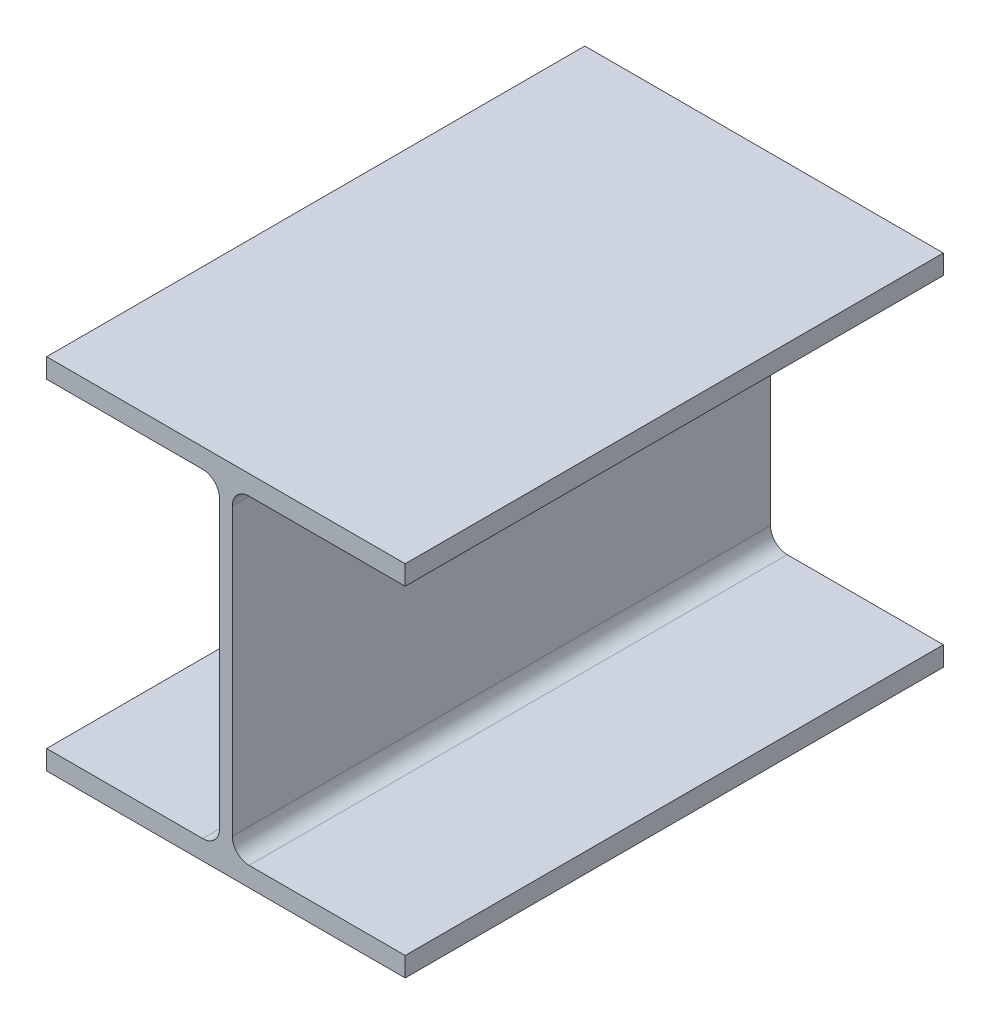
ISO-10303-21;
HEADER;
FILE_DESCRIPTION(('STEP AP214'),'2;1');
FILE_NAME('part.step','',(''),(''),'','','');
FILE_SCHEMA(('AUTOMOTIVE_DESIGN { 1 0 10303 214 1 1 1 1 }'));
ENDSEC;
DATA;
#1=APPLICATION_CONTEXT('core data for automotive mechanical design processes');
#2=APPLICATION_PROTOCOL_DEFINITION('international standard','automotive_design',2000,#1);
#3=PRODUCT_CONTEXT('',#1,'mechanical');
#4=PRODUCT('Part','Part','',(#3));
#5=PRODUCT_RELATED_PRODUCT_CATEGORY('part','',(#4));
#6=PRODUCT_DEFINITION_FORMATION('','',#4);
#7=PRODUCT_DEFINITION_CONTEXT('part definition',#1,'design');
#8=PRODUCT_DEFINITION('design','',#6,#7);
#9=PRODUCT_DEFINITION_SHAPE('','',#8);
#10=(LENGTH_UNIT() NAMED_UNIT(*) SI_UNIT(.MILLI.,.METRE.));
#11=(NAMED_UNIT(*) PLANE_ANGLE_UNIT() SI_UNIT($,.RADIAN.));
#12=(NAMED_UNIT(*) SI_UNIT($,.STERADIAN.) SOLID_ANGLE_UNIT());
#13=UNCERTAINTY_MEASURE_WITH_UNIT(LENGTH_MEASURE(1.E-05),#10,'distance_accuracy_value','');
#14=(GEOMETRIC_REPRESENTATION_CONTEXT(3) GLOBAL_UNCERTAINTY_ASSIGNED_CONTEXT((#13)) GLOBAL_UNIT_ASSIGNED_CONTEXT((#10,
#11,#12)) REPRESENTATION_CONTEXT('',''));
#15=CARTESIAN_POINT('',(0.,0.,0.));
#16=DIRECTION('',(0.,0.,1.));
#17=DIRECTION('',(1.,0.,0.));
#18=AXIS2_PLACEMENT_3D('',#15,#16,#17);
#19=CARTESIAN_POINT('',(-101.5365,-90.551,152.4));
#20=DIRECTION('',(1.,0.,0.));
#21=DIRECTION('',(0.,0.,-1.));
#22=AXIS2_PLACEMENT_3D('',#19,#20,#21);
#23=PLANE('',#22);
#24=DIRECTION('',(0.,-1.,0.));
#25=VECTOR('',#24,1.);
#26=CARTESIAN_POINT('',(-101.5365,-90.551,-152.4));
#27=LINE('',#26,#25);
#28=CARTESIAN_POINT('',(-101.5365,-90.551,-152.4));
#29=VERTEX_POINT('',#28);
#30=CARTESIAN_POINT('',(-101.5365,-101.6,-152.4));
#31=VERTEX_POINT('',#30);
#32=EDGE_CURVE('E169',#29,#31,#27,.T.);
#33=ORIENTED_EDGE('',*,*,#32,.T.);
#34=DIRECTION('',(0.,0.,-1.));
#35=VECTOR('',#34,1.);
#36=CARTESIAN_POINT('',(-101.5365,-101.6,152.4));
#37=LINE('',#36,#35);
#38=CARTESIAN_POINT('',(-101.5365,-101.6,152.4));
#39=VERTEX_POINT('',#38);
#40=EDGE_CURVE('E151',#39,#31,#37,.T.);
#41=ORIENTED_EDGE('',*,*,#40,.F.);
#42=DIRECTION('',(0.,-1.,0.));
#43=VECTOR('',#42,1.);
#44=CARTESIAN_POINT('',(-101.5365,-90.551,152.4));
#45=LINE('',#44,#43);
#46=CARTESIAN_POINT('',(-101.5365,-90.551,152.4));
#47=VERTEX_POINT('',#46);
#48=EDGE_CURVE('E158',#47,#39,#45,.T.);
#49=ORIENTED_EDGE('',*,*,#48,.F.);
#50=DIRECTION('',(0.,0.,-1.));
#51=VECTOR('',#50,1.);
#52=CARTESIAN_POINT('',(-101.5365,-90.551,152.4));
#53=LINE('',#52,#51);
#54=EDGE_CURVE('E216',#47,#29,#53,.T.);
#55=ORIENTED_EDGE('',*,*,#54,.T.);
#56=EDGE_LOOP('',(#33,#41,#49,#55));
#57=FACE_BOUND('',#56,.T.);
#58=ADVANCED_FACE('F35',(#57),#23,.F.);
#59=CARTESIAN_POINT('',(-101.5365,-101.6,152.4));
#60=DIRECTION('',(0.,1.,0.));
#61=DIRECTION('',(-1.,0.,0.));
#62=AXIS2_PLACEMENT_3D('',#59,#60,#61);
#63=PLANE('',#62);
#64=DIRECTION('',(1.,0.,0.));
#65=VECTOR('',#64,1.);
#66=CARTESIAN_POINT('',(-101.5365,-101.6,-152.4));
#67=LINE('',#66,#65);
#68=CARTESIAN_POINT('',(101.5365,-101.6,-152.4));
#69=VERTEX_POINT('',#68);
#70=EDGE_CURVE('E254',#31,#69,#67,.T.);
#71=ORIENTED_EDGE('',*,*,#70,.T.);
#72=DIRECTION('',(0.,0.,-1.));
#73=VECTOR('',#72,1.);
#74=CARTESIAN_POINT('',(101.5365,-101.6,152.4));
#75=LINE('',#74,#73);
#76=CARTESIAN_POINT('',(101.5365,-101.6,152.4));
#77=VERTEX_POINT('',#76);
#78=EDGE_CURVE('E153',#77,#69,#75,.T.);
#79=ORIENTED_EDGE('',*,*,#78,.F.);
#80=DIRECTION('',(1.,0.,0.));
#81=VECTOR('',#80,1.);
#82=CARTESIAN_POINT('',(-101.5365,-101.6,152.4));
#83=LINE('',#82,#81);
#84=EDGE_CURVE('E146',#39,#77,#83,.T.);
#85=ORIENTED_EDGE('',*,*,#84,.F.);
#86=ORIENTED_EDGE('',*,*,#40,.T.);
#87=EDGE_LOOP('',(#71,#79,#85,#86));
#88=FACE_BOUND('',#87,.T.);
#89=ADVANCED_FACE('F149',(#88),#63,.F.);
#90=CARTESIAN_POINT('',(101.5365,-90.551,152.4));
#91=DIRECTION('',(1.,0.,0.));
#92=DIRECTION('',(0.,1.,0.));
#93=AXIS2_PLACEMENT_3D('',#90,#91,#92);
#94=PLANE('',#93);
#95=DIRECTION('',(0.,-1.,0.));
#96=VECTOR('',#95,1.);
#97=CARTESIAN_POINT('',(101.5365,-90.551,-152.4));
#98=LINE('',#97,#96);
#99=CARTESIAN_POINT('',(101.5365,-90.551,-152.4));
#100=VERTEX_POINT('',#99);
#101=EDGE_CURVE('E252',#100,#69,#98,.T.);
#102=ORIENTED_EDGE('',*,*,#101,.F.);
#103=DIRECTION('',(0.,0.,-1.));
#104=VECTOR('',#103,1.);
#105=CARTESIAN_POINT('',(101.5365,-90.551,152.4));
#106=LINE('',#105,#104);
#107=CARTESIAN_POINT('',(101.5365,-90.551,152.4));
#108=VERTEX_POINT('',#107);
#109=EDGE_CURVE('E174',#108,#100,#106,.T.);
#110=ORIENTED_EDGE('',*,*,#109,.F.);
#111=DIRECTION('',(0.,-1.,0.));
#112=VECTOR('',#111,1.);
#113=CARTESIAN_POINT('',(101.5365,-90.551,152.4));
#114=LINE('',#113,#112);
#115=EDGE_CURVE('E157',#108,#77,#114,.T.);
#116=ORIENTED_EDGE('',*,*,#115,.T.);
#117=ORIENTED_EDGE('',*,*,#78,.T.);
#118=EDGE_LOOP('',(#102,#110,#116,#117));
#119=FACE_BOUND('',#118,.T.);
#120=ADVANCED_FACE('F253',(#119),#94,.T.);
#121=CARTESIAN_POINT('',(3.61950000000003,-90.551,152.4));
#122=DIRECTION('',(0.,1.,0.));
#123=DIRECTION('',(0.,0.,1.));
#124=AXIS2_PLACEMENT_3D('',#121,#122,#123);
#125=PLANE('',#124);
#126=DIRECTION('',(1.,0.,0.));
#127=VECTOR('',#126,1.);
#128=CARTESIAN_POINT('',(3.61950000000003,-90.551,-152.4));
#129=LINE('',#128,#127);
#130=CARTESIAN_POINT('',(13.1445,-90.551,-152.4));
#131=VERTEX_POINT('',#130);
#132=EDGE_CURVE('E248',#131,#100,#129,.T.);
#133=ORIENTED_EDGE('',*,*,#132,.F.);
#134=DIRECTION('',(0.,0.,-1.));
#135=VECTOR('',#134,1.);
#136=CARTESIAN_POINT('',(13.1445,-90.551,152.4));
#137=LINE('',#136,#135);
#138=CARTESIAN_POINT('',(13.1445,-90.551,152.4));
#139=VERTEX_POINT('',#138);
#140=EDGE_CURVE('E50',#131,#139,#137,.F.);
#141=ORIENTED_EDGE('',*,*,#140,.T.);
#142=DIRECTION('',(1.,0.,0.));
#143=VECTOR('',#142,1.);
#144=CARTESIAN_POINT('',(3.61950000000003,-90.551,152.4));
#145=LINE('',#144,#143);
#146=EDGE_CURVE('E249',#139,#108,#145,.T.);
#147=ORIENTED_EDGE('',*,*,#146,.T.);
#148=ORIENTED_EDGE('',*,*,#109,.T.);
#149=EDGE_LOOP('',(#133,#141,#147,#148));
#150=FACE_BOUND('',#149,.T.);
#151=ADVANCED_FACE('F247',(#150),#125,.T.);
#152=CARTESIAN_POINT('',(3.6195,90.551,152.4));
#153=DIRECTION('',(1.,0.,0.));
#154=DIRECTION('',(0.,1.,0.));
#155=AXIS2_PLACEMENT_3D('',#152,#153,#154);
#156=PLANE('',#155);
#157=DIRECTION('',(0.,-1.,0.));
#158=VECTOR('',#157,1.);
#159=CARTESIAN_POINT('',(3.6195,90.551,-152.4));
#160=LINE('',#159,#158);
#161=CARTESIAN_POINT('',(3.6195,81.026,-152.4));
#162=VERTEX_POINT('',#161);
#163=CARTESIAN_POINT('',(3.61950000000002,-81.026,-152.4));
#164=VERTEX_POINT('',#163);
#165=EDGE_CURVE('E256',#162,#164,#160,.T.);
#166=ORIENTED_EDGE('',*,*,#165,.F.);
#167=DIRECTION('',(0.,0.,-1.));
#168=VECTOR('',#167,1.);
#169=CARTESIAN_POINT('',(3.6195,81.026,152.4));
#170=LINE('',#169,#168);
#171=CARTESIAN_POINT('',(3.6195,81.026,152.4));
#172=VERTEX_POINT('',#171);
#173=EDGE_CURVE('E188',#162,#172,#170,.F.);
#174=ORIENTED_EDGE('',*,*,#173,.T.);
#175=DIRECTION('',(0.,-1.,0.));
#176=VECTOR('',#175,1.);
#177=CARTESIAN_POINT('',(3.6195,90.551,152.4));
#178=LINE('',#177,#176);
#179=CARTESIAN_POINT('',(3.61950000000002,-81.026,152.4));
#180=VERTEX_POINT('',#179);
#181=EDGE_CURVE('E299',#172,#180,#178,.T.);
#182=ORIENTED_EDGE('',*,*,#181,.T.);
#183=DIRECTION('',(0.,0.,-1.));
#184=VECTOR('',#183,1.);
#185=CARTESIAN_POINT('',(3.61950000000003,-81.026,-152.4));
#186=LINE('',#185,#184);
#187=EDGE_CURVE('E185',#180,#164,#186,.T.);
#188=ORIENTED_EDGE('',*,*,#187,.T.);
#189=EDGE_LOOP('',(#166,#174,#182,#188));
#190=FACE_BOUND('',#189,.T.);
#191=ADVANCED_FACE('F309',(#190),#156,.T.);
#192=CARTESIAN_POINT('',(3.6195,90.551,152.4));
#193=DIRECTION('',(0.,1.,0.));
#194=DIRECTION('',(0.,0.,1.));
#195=AXIS2_PLACEMENT_3D('',#192,#193,#194);
#196=PLANE('',#195);
#197=DIRECTION('',(1.,0.,0.));
#198=VECTOR('',#197,1.);
#199=CARTESIAN_POINT('',(3.6195,90.551,152.4));
#200=LINE('',#199,#198);
#201=CARTESIAN_POINT('',(13.1445,90.551,152.4));
#202=VERTEX_POINT('',#201);
#203=CARTESIAN_POINT('',(101.5365,90.551,152.4));
#204=VERTEX_POINT('',#203);
#205=EDGE_CURVE('E297',#202,#204,#200,.T.);
#206=ORIENTED_EDGE('',*,*,#205,.F.);
#207=DIRECTION('',(0.,0.,-1.));
#208=VECTOR('',#207,1.);
#209=CARTESIAN_POINT('',(13.1445,90.551,152.4));
#210=LINE('',#209,#208);
#211=CARTESIAN_POINT('',(13.1445,90.551,-152.4));
#212=VERTEX_POINT('',#211);
#213=EDGE_CURVE('E182',#202,#212,#210,.T.);
#214=ORIENTED_EDGE('',*,*,#213,.T.);
#215=DIRECTION('',(1.,0.,0.));
#216=VECTOR('',#215,1.);
#217=CARTESIAN_POINT('',(3.6195,90.551,-152.4));
#218=LINE('',#217,#216);
#219=CARTESIAN_POINT('',(101.5365,90.551,-152.4));
#220=VERTEX_POINT('',#219);
#221=EDGE_CURVE('E262',#212,#220,#218,.T.);
#222=ORIENTED_EDGE('',*,*,#221,.T.);
#223=DIRECTION('',(0.,0.,-1.));
#224=VECTOR('',#223,1.);
#225=CARTESIAN_POINT('',(101.5365,90.551,152.4));
#226=LINE('',#225,#224);
#227=EDGE_CURVE('E242',#204,#220,#226,.T.);
#228=ORIENTED_EDGE('',*,*,#227,.F.);
#229=EDGE_LOOP('',(#206,#214,#222,#228));
#230=FACE_BOUND('',#229,.T.);
#231=ADVANCED_FACE('F318',(#230),#196,.F.);
#232=CARTESIAN_POINT('',(101.5365,101.6,152.4));
#233=DIRECTION('',(1.,0.,0.));
#234=DIRECTION('',(0.,1.,0.));
#235=AXIS2_PLACEMENT_3D('',#232,#233,#234);
#236=PLANE('',#235);
#237=DIRECTION('',(0.,-1.,0.));
#238=VECTOR('',#237,1.);
#239=CARTESIAN_POINT('',(101.5365,101.6,-152.4));
#240=LINE('',#239,#238);
#241=CARTESIAN_POINT('',(101.5365,101.6,-152.4));
#242=VERTEX_POINT('',#241);
#243=EDGE_CURVE('E264',#242,#220,#240,.T.);
#244=ORIENTED_EDGE('',*,*,#243,.F.);
#245=DIRECTION('',(0.,0.,-1.));
#246=VECTOR('',#245,1.);
#247=CARTESIAN_POINT('',(101.5365,101.6,152.4));
#248=LINE('',#247,#246);
#249=CARTESIAN_POINT('',(101.5365,101.6,152.4));
#250=VERTEX_POINT('',#249);
#251=EDGE_CURVE('E240',#250,#242,#248,.T.);
#252=ORIENTED_EDGE('',*,*,#251,.F.);
#253=DIRECTION('',(0.,-1.,0.));
#254=VECTOR('',#253,1.);
#255=CARTESIAN_POINT('',(101.5365,101.6,152.4));
#256=LINE('',#255,#254);
#257=EDGE_CURVE('E294',#250,#204,#256,.T.);
#258=ORIENTED_EDGE('',*,*,#257,.T.);
#259=ORIENTED_EDGE('',*,*,#227,.T.);
#260=EDGE_LOOP('',(#244,#252,#258,#259));
#261=FACE_BOUND('',#260,.T.);
#262=ADVANCED_FACE('F325',(#261),#236,.T.);
#263=CARTESIAN_POINT('',(-101.5365,101.6,152.4));
#264=DIRECTION('',(0.,1.,0.));
#265=DIRECTION('',(-1.,0.,0.));
#266=AXIS2_PLACEMENT_3D('',#263,#264,#265);
#267=PLANE('',#266);
#268=DIRECTION('',(1.,0.,0.));
#269=VECTOR('',#268,1.);
#270=CARTESIAN_POINT('',(-101.5365,101.6,-152.4));
#271=LINE('',#270,#269);
#272=CARTESIAN_POINT('',(-101.5365,101.6,-152.4));
#273=VERTEX_POINT('',#272);
#274=EDGE_CURVE('E267',#273,#242,#271,.T.);
#275=ORIENTED_EDGE('',*,*,#274,.F.);
#276=DIRECTION('',(0.,0.,-1.));
#277=VECTOR('',#276,1.);
#278=CARTESIAN_POINT('',(-101.5365,101.6,152.4));
#279=LINE('',#278,#277);
#280=CARTESIAN_POINT('',(-101.5365,101.6,152.4));
#281=VERTEX_POINT('',#280);
#282=EDGE_CURVE('E238',#281,#273,#279,.T.);
#283=ORIENTED_EDGE('',*,*,#282,.F.);
#284=DIRECTION('',(1.,0.,0.));
#285=VECTOR('',#284,1.);
#286=CARTESIAN_POINT('',(-101.5365,101.6,152.4));
#287=LINE('',#286,#285);
#288=EDGE_CURVE('E289',#281,#250,#287,.T.);
#289=ORIENTED_EDGE('',*,*,#288,.T.);
#290=ORIENTED_EDGE('',*,*,#251,.T.);
#291=EDGE_LOOP('',(#275,#283,#289,#290));
#292=FACE_BOUND('',#291,.T.);
#293=ADVANCED_FACE('F323',(#292),#267,.T.);
#294=CARTESIAN_POINT('',(-101.5365,101.6,152.4));
#295=DIRECTION('',(1.,0.,0.));
#296=DIRECTION('',(0.,1.,0.));
#297=AXIS2_PLACEMENT_3D('',#294,#295,#296);
#298=PLANE('',#297);
#299=DIRECTION('',(0.,-1.,0.));
#300=VECTOR('',#299,1.);
#301=CARTESIAN_POINT('',(-101.5365,101.6,-152.4));
#302=LINE('',#301,#300);
#303=CARTESIAN_POINT('',(-101.5365,90.551,-152.4));
#304=VERTEX_POINT('',#303);
#305=EDGE_CURVE('E230',#273,#304,#302,.T.);
#306=ORIENTED_EDGE('',*,*,#305,.T.);
#307=DIRECTION('',(0.,0.,-1.));
#308=VECTOR('',#307,1.);
#309=CARTESIAN_POINT('',(-101.5365,90.551,152.4));
#310=LINE('',#309,#308);
#311=CARTESIAN_POINT('',(-101.5365,90.551,152.4));
#312=VERTEX_POINT('',#311);
#313=EDGE_CURVE('E235',#312,#304,#310,.T.);
#314=ORIENTED_EDGE('',*,*,#313,.F.);
#315=DIRECTION('',(0.,-1.,0.));
#316=VECTOR('',#315,1.);
#317=CARTESIAN_POINT('',(-101.5365,101.6,152.4));
#318=LINE('',#317,#316);
#319=EDGE_CURVE('E286',#281,#312,#318,.T.);
#320=ORIENTED_EDGE('',*,*,#319,.F.);
#321=ORIENTED_EDGE('',*,*,#282,.T.);
#322=EDGE_LOOP('',(#306,#314,#320,#321));
#323=FACE_BOUND('',#322,.T.);
#324=ADVANCED_FACE('F272',(#323),#298,.F.);
#325=CARTESIAN_POINT('',(-101.5365,90.551,152.4));
#326=DIRECTION('',(0.,1.,0.));
#327=DIRECTION('',(0.,0.,1.));
#328=AXIS2_PLACEMENT_3D('',#325,#326,#327);
#329=PLANE('',#328);
#330=DIRECTION('',(1.,0.,0.));
#331=VECTOR('',#330,1.);
#332=CARTESIAN_POINT('',(-101.5365,90.551,-152.4));
#333=LINE('',#332,#331);
#334=CARTESIAN_POINT('',(-13.1445,90.551,-152.4));
#335=VERTEX_POINT('',#334);
#336=EDGE_CURVE('E226',#304,#335,#333,.T.);
#337=ORIENTED_EDGE('',*,*,#336,.T.);
#338=DIRECTION('',(0.,0.,-1.));
#339=VECTOR('',#338,1.);
#340=CARTESIAN_POINT('',(-13.1445,90.551,152.4));
#341=LINE('',#340,#339);
#342=CARTESIAN_POINT('',(-13.1445,90.551,152.4));
#343=VERTEX_POINT('',#342);
#344=EDGE_CURVE('E180',#335,#343,#341,.F.);
#345=ORIENTED_EDGE('',*,*,#344,.T.);
#346=DIRECTION('',(1.,0.,0.));
#347=VECTOR('',#346,1.);
#348=CARTESIAN_POINT('',(-101.5365,90.551,152.4));
#349=LINE('',#348,#347);
#350=EDGE_CURVE('E281',#312,#343,#349,.T.);
#351=ORIENTED_EDGE('',*,*,#350,.F.);
#352=ORIENTED_EDGE('',*,*,#313,.T.);
#353=EDGE_LOOP('',(#337,#345,#351,#352));
#354=FACE_BOUND('',#353,.T.);
#355=ADVANCED_FACE('F278',(#354),#329,.F.);
#356=CARTESIAN_POINT('',(-3.6195,90.551,152.4));
#357=DIRECTION('',(1.,0.,0.));
#358=DIRECTION('',(0.,1.,0.));
#359=AXIS2_PLACEMENT_3D('',#356,#357,#358);
#360=PLANE('',#359);
#361=DIRECTION('',(0.,-1.,0.));
#362=VECTOR('',#361,1.);
#363=CARTESIAN_POINT('',(-3.6195,90.551,152.4));
#364=LINE('',#363,#362);
#365=CARTESIAN_POINT('',(-3.6195,81.026,152.4));
#366=VERTEX_POINT('',#365);
#367=CARTESIAN_POINT('',(-3.61950000000002,-81.026,152.4));
#368=VERTEX_POINT('',#367);
#369=EDGE_CURVE('E208',#366,#368,#364,.T.);
#370=ORIENTED_EDGE('',*,*,#369,.F.);
#371=DIRECTION('',(0.,0.,-1.));
#372=VECTOR('',#371,1.);
#373=CARTESIAN_POINT('',(-3.6195,81.026,-152.4));
#374=LINE('',#373,#372);
#375=CARTESIAN_POINT('',(-3.6195,81.026,-152.4));
#376=VERTEX_POINT('',#375);
#377=EDGE_CURVE('E172',#366,#376,#374,.T.);
#378=ORIENTED_EDGE('',*,*,#377,.T.);
#379=DIRECTION('',(0.,-1.,0.));
#380=VECTOR('',#379,1.);
#381=CARTESIAN_POINT('',(-3.6195,90.551,-152.4));
#382=LINE('',#381,#380);
#383=CARTESIAN_POINT('',(-3.61950000000002,-81.026,-152.4));
#384=VERTEX_POINT('',#383);
#385=EDGE_CURVE('E222',#376,#384,#382,.T.);
#386=ORIENTED_EDGE('',*,*,#385,.T.);
#387=DIRECTION('',(0.,0.,-1.));
#388=VECTOR('',#387,1.);
#389=CARTESIAN_POINT('',(-3.61950000000002,-81.026,152.4));
#390=LINE('',#389,#388);
#391=EDGE_CURVE('E170',#384,#368,#390,.F.);
#392=ORIENTED_EDGE('',*,*,#391,.T.);
#393=EDGE_LOOP('',(#370,#378,#386,#392));
#394=FACE_BOUND('',#393,.T.);
#395=ADVANCED_FACE('F224',(#394),#360,.F.);
#396=CARTESIAN_POINT('',(-101.5365,-90.551,152.4));
#397=DIRECTION('',(0.,1.,0.));
#398=DIRECTION('',(0.,0.,1.));
#399=AXIS2_PLACEMENT_3D('',#396,#397,#398);
#400=PLANE('',#399);
#401=DIRECTION('',(1.,0.,0.));
#402=VECTOR('',#401,1.);
#403=CARTESIAN_POINT('',(-101.5365,-90.551,152.4));
#404=LINE('',#403,#402);
#405=CARTESIAN_POINT('',(-13.1445,-90.551,152.4));
#406=VERTEX_POINT('',#405);
#407=EDGE_CURVE('E164',#47,#406,#404,.T.);
#408=ORIENTED_EDGE('',*,*,#407,.T.);
#409=DIRECTION('',(0.,0.,-1.));
#410=VECTOR('',#409,1.);
#411=CARTESIAN_POINT('',(-13.1445,-90.551,152.4));
#412=LINE('',#411,#410);
#413=CARTESIAN_POINT('',(-13.1445,-90.551,-152.4));
#414=VERTEX_POINT('',#413);
#415=EDGE_CURVE('E190',#406,#414,#412,.T.);
#416=ORIENTED_EDGE('',*,*,#415,.T.);
#417=DIRECTION('',(1.,0.,0.));
#418=VECTOR('',#417,1.);
#419=CARTESIAN_POINT('',(-101.5365,-90.551,-152.4));
#420=LINE('',#419,#418);
#421=EDGE_CURVE('E166',#29,#414,#420,.T.);
#422=ORIENTED_EDGE('',*,*,#421,.F.);
#423=ORIENTED_EDGE('',*,*,#54,.F.);
#424=EDGE_LOOP('',(#408,#416,#422,#423));
#425=FACE_BOUND('',#424,.T.);
#426=ADVANCED_FACE('F213',(#425),#400,.T.);
#427=CARTESIAN_POINT('',(0.,0.,152.4));
#428=DIRECTION('',(0.,0.,1.));
#429=DIRECTION('',(1.,0.,0.));
#430=AXIS2_PLACEMENT_3D('',#427,#428,#429);
#431=PLANE('',#430);
#432=ORIENTED_EDGE('',*,*,#48,.T.);
#433=ORIENTED_EDGE('',*,*,#84,.T.);
#434=ORIENTED_EDGE('',*,*,#115,.F.);
#435=ORIENTED_EDGE('',*,*,#146,.F.);
#436=CARTESIAN_POINT('',(13.1445,-81.026,152.4));
#437=DIRECTION('',(0.,0.,1.));
#438=DIRECTION('',(1.,0.,0.));
#439=AXIS2_PLACEMENT_3D('',#436,#437,#438);
#440=CIRCLE('',#439,9.525);
#441=EDGE_CURVE('E11',#139,#180,#440,.F.);
#442=ORIENTED_EDGE('',*,*,#441,.T.);
#443=ORIENTED_EDGE('',*,*,#181,.F.);
#444=CARTESIAN_POINT('',(13.1445,81.026,152.4));
#445=DIRECTION('',(0.,0.,1.));
#446=DIRECTION('',(1.,0.,0.));
#447=AXIS2_PLACEMENT_3D('',#444,#445,#446);
#448=CIRCLE('',#447,9.525);
#449=EDGE_CURVE('E200',#172,#202,#448,.F.);
#450=ORIENTED_EDGE('',*,*,#449,.T.);
#451=ORIENTED_EDGE('',*,*,#205,.T.);
#452=ORIENTED_EDGE('',*,*,#257,.F.);
#453=ORIENTED_EDGE('',*,*,#288,.F.);
#454=ORIENTED_EDGE('',*,*,#319,.T.);
#455=ORIENTED_EDGE('',*,*,#350,.T.);
#456=CARTESIAN_POINT('',(-13.1445,81.026,152.4));
#457=DIRECTION('',(0.,0.,1.));
#458=DIRECTION('',(1.,0.,0.));
#459=AXIS2_PLACEMENT_3D('',#456,#457,#458);
#460=CIRCLE('',#459,9.525);
#461=EDGE_CURVE('E196',#343,#366,#460,.F.);
#462=ORIENTED_EDGE('',*,*,#461,.T.);
#463=ORIENTED_EDGE('',*,*,#369,.T.);
#464=CARTESIAN_POINT('',(-13.1445,-81.026,152.4));
#465=DIRECTION('',(0.,0.,1.));
#466=DIRECTION('',(1.,0.,0.));
#467=AXIS2_PLACEMENT_3D('',#464,#465,#466);
#468=CIRCLE('',#467,9.525);
#469=EDGE_CURVE('E204',#368,#406,#468,.F.);
#470=ORIENTED_EDGE('',*,*,#469,.T.);
#471=ORIENTED_EDGE('',*,*,#407,.F.);
#472=EDGE_LOOP('',(#432,#433,#434,#435,#442,#443,#450,#451,#452,#453,#454,#455,#462,#463,#470,#471));
#473=FACE_BOUND('',#472,.T.);
#474=ADVANCED_FACE('F162',(#473),#431,.T.);
#475=CARTESIAN_POINT('',(0.,0.,-152.4));
#476=DIRECTION('',(0.,0.,1.));
#477=DIRECTION('',(1.,0.,0.));
#478=AXIS2_PLACEMENT_3D('',#475,#476,#477);
#479=PLANE('',#478);
#480=ORIENTED_EDGE('',*,*,#32,.F.);
#481=ORIENTED_EDGE('',*,*,#421,.T.);
#482=CARTESIAN_POINT('',(-13.1445,-81.026,-152.4));
#483=DIRECTION('',(0.,0.,1.));
#484=DIRECTION('',(1.,0.,0.));
#485=AXIS2_PLACEMENT_3D('',#482,#483,#484);
#486=CIRCLE('',#485,9.525);
#487=EDGE_CURVE('E202',#414,#384,#486,.T.);
#488=ORIENTED_EDGE('',*,*,#487,.T.);
#489=ORIENTED_EDGE('',*,*,#385,.F.);
#490=CARTESIAN_POINT('',(-13.1445,81.026,-152.4));
#491=DIRECTION('',(0.,0.,1.));
#492=DIRECTION('',(1.,0.,0.));
#493=AXIS2_PLACEMENT_3D('',#490,#491,#492);
#494=CIRCLE('',#493,9.525);
#495=EDGE_CURVE('E194',#376,#335,#494,.T.);
#496=ORIENTED_EDGE('',*,*,#495,.T.);
#497=ORIENTED_EDGE('',*,*,#336,.F.);
#498=ORIENTED_EDGE('',*,*,#305,.F.);
#499=ORIENTED_EDGE('',*,*,#274,.T.);
#500=ORIENTED_EDGE('',*,*,#243,.T.);
#501=ORIENTED_EDGE('',*,*,#221,.F.);
#502=CARTESIAN_POINT('',(13.1445,81.026,-152.4));
#503=DIRECTION('',(0.,0.,1.));
#504=DIRECTION('',(1.,0.,0.));
#505=AXIS2_PLACEMENT_3D('',#502,#503,#504);
#506=CIRCLE('',#505,9.525);
#507=EDGE_CURVE('E198',#212,#162,#506,.T.);
#508=ORIENTED_EDGE('',*,*,#507,.T.);
#509=ORIENTED_EDGE('',*,*,#165,.T.);
#510=CARTESIAN_POINT('',(13.1445,-81.026,-152.4));
#511=DIRECTION('',(0.,0.,1.));
#512=DIRECTION('',(1.,0.,0.));
#513=AXIS2_PLACEMENT_3D('',#510,#511,#512);
#514=CIRCLE('',#513,9.525);
#515=EDGE_CURVE('E43',#164,#131,#514,.T.);
#516=ORIENTED_EDGE('',*,*,#515,.T.);
#517=ORIENTED_EDGE('',*,*,#132,.T.);
#518=ORIENTED_EDGE('',*,*,#101,.T.);
#519=ORIENTED_EDGE('',*,*,#70,.F.);
#520=EDGE_LOOP('',(#480,#481,#488,#489,#496,#497,#498,#499,#500,#501,#508,#509,#516,#517,#518,#519));
#521=FACE_BOUND('',#520,.T.);
#522=ADVANCED_FACE('F221',(#521),#479,.F.);
#523=CARTESIAN_POINT('',(-13.1445,81.026,152.4));
#524=DIRECTION('',(0.,0.,1.));
#525=DIRECTION('',(1.,0.,0.));
#526=AXIS2_PLACEMENT_3D('',#523,#524,#525);
#527=CYLINDRICAL_SURFACE('',#526,9.525);
#528=ORIENTED_EDGE('',*,*,#461,.F.);
#529=ORIENTED_EDGE('',*,*,#344,.F.);
#530=ORIENTED_EDGE('',*,*,#495,.F.);
#531=ORIENTED_EDGE('',*,*,#377,.F.);
#532=EDGE_LOOP('',(#528,#529,#530,#531));
#533=FACE_BOUND('',#532,.T.);
#534=ADVANCED_FACE('F284',(#533),#527,.F.);
#535=CARTESIAN_POINT('',(13.1445,81.026,152.4));
#536=DIRECTION('',(0.,0.,-1.));
#537=DIRECTION('',(-1.,0.,0.));
#538=AXIS2_PLACEMENT_3D('',#535,#536,#537);
#539=CYLINDRICAL_SURFACE('',#538,9.525);
#540=ORIENTED_EDGE('',*,*,#449,.F.);
#541=ORIENTED_EDGE('',*,*,#173,.F.);
#542=ORIENTED_EDGE('',*,*,#507,.F.);
#543=ORIENTED_EDGE('',*,*,#213,.F.);
#544=EDGE_LOOP('',(#540,#541,#542,#543));
#545=FACE_BOUND('',#544,.T.);
#546=ADVANCED_FACE('F315',(#545),#539,.F.);
#547=CARTESIAN_POINT('',(-13.1445,-81.026,152.4));
#548=DIRECTION('',(0.,0.,-1.));
#549=DIRECTION('',(-1.,0.,0.));
#550=AXIS2_PLACEMENT_3D('',#547,#548,#549);
#551=CYLINDRICAL_SURFACE('',#550,9.525);
#552=ORIENTED_EDGE('',*,*,#469,.F.);
#553=ORIENTED_EDGE('',*,*,#391,.F.);
#554=ORIENTED_EDGE('',*,*,#487,.F.);
#555=ORIENTED_EDGE('',*,*,#415,.F.);
#556=EDGE_LOOP('',(#552,#553,#554,#555));
#557=FACE_BOUND('',#556,.T.);
#558=ADVANCED_FACE('F218',(#557),#551,.F.);
#559=CARTESIAN_POINT('',(13.1445,-81.026,152.4));
#560=DIRECTION('',(0.,0.,1.));
#561=DIRECTION('',(1.,0.,0.));
#562=AXIS2_PLACEMENT_3D('',#559,#560,#561);
#563=CYLINDRICAL_SURFACE('',#562,9.525);
#564=ORIENTED_EDGE('',*,*,#441,.F.);
#565=ORIENTED_EDGE('',*,*,#140,.F.);
#566=ORIENTED_EDGE('',*,*,#515,.F.);
#567=ORIENTED_EDGE('',*,*,#187,.F.);
#568=EDGE_LOOP('',(#564,#565,#566,#567));
#569=FACE_BOUND('',#568,.T.);
#570=ADVANCED_FACE('F37',(#569),#563,.F.);
#571=CLOSED_SHELL('',(#58,#89,#120,#151,#191,#231,#262,#293,#324,#355,#395,#426,#474,#522,#534,
#546,#558,#570));
#572=MANIFOLD_SOLID_BREP('B2',#571);
#573=ADVANCED_BREP_SHAPE_REPRESENTATION('',(#18,#572),#14);
#574=SHAPE_DEFINITION_REPRESENTATION(#9,#573);
ENDSEC;
END-ISO-10303-21;
